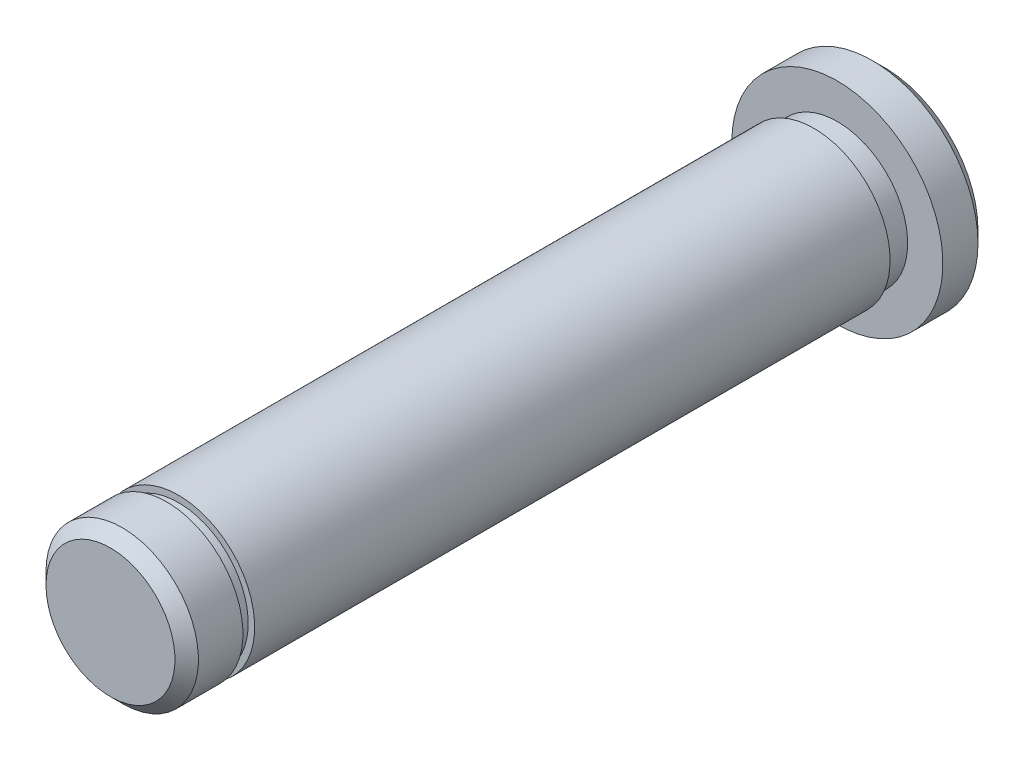
ISO-10303-21;
HEADER;
FILE_DESCRIPTION(('STEP AP214'),'2;1');
FILE_NAME('part.step','',(''),(''),'','','');
FILE_SCHEMA(('AUTOMOTIVE_DESIGN { 1 0 10303 214 1 1 1 1 }'));
ENDSEC;
DATA;
#1=APPLICATION_CONTEXT('core data for automotive mechanical design processes');
#2=APPLICATION_PROTOCOL_DEFINITION('international standard','automotive_design',2000,#1);
#3=PRODUCT_CONTEXT('',#1,'mechanical');
#4=PRODUCT('Part','Part','',(#3));
#5=PRODUCT_RELATED_PRODUCT_CATEGORY('part','',(#4));
#6=PRODUCT_DEFINITION_FORMATION('','',#4);
#7=PRODUCT_DEFINITION_CONTEXT('part definition',#1,'design');
#8=PRODUCT_DEFINITION('design','',#6,#7);
#9=PRODUCT_DEFINITION_SHAPE('','',#8);
#10=(LENGTH_UNIT() NAMED_UNIT(*) SI_UNIT(.MILLI.,.METRE.));
#11=(NAMED_UNIT(*) PLANE_ANGLE_UNIT() SI_UNIT($,.RADIAN.));
#12=(NAMED_UNIT(*) SI_UNIT($,.STERADIAN.) SOLID_ANGLE_UNIT());
#13=UNCERTAINTY_MEASURE_WITH_UNIT(LENGTH_MEASURE(1.E-05),#10,'distance_accuracy_value','');
#14=(GEOMETRIC_REPRESENTATION_CONTEXT(3) GLOBAL_UNCERTAINTY_ASSIGNED_CONTEXT((#13)) GLOBAL_UNIT_ASSIGNED_CONTEXT((#10,
#11,#12)) REPRESENTATION_CONTEXT('',''));
#15=CARTESIAN_POINT('',(0.,0.,0.));
#16=DIRECTION('',(0.,0.,1.));
#17=DIRECTION('',(1.,0.,0.));
#18=AXIS2_PLACEMENT_3D('',#15,#16,#17);
#19=CARTESIAN_POINT('',(0.,0.,66.));
#20=DIRECTION('',(0.,0.,1.));
#21=DIRECTION('',(1.,0.,0.));
#22=AXIS2_PLACEMENT_3D('',#19,#20,#21);
#23=PLANE('',#22);
#24=CARTESIAN_POINT('',(0.,0.,65.9999999999172));
#25=DIRECTION('',(0.,0.,-1.));
#26=DIRECTION('',(-1.,0.,0.));
#27=AXIS2_PLACEMENT_3D('',#24,#25,#26);
#28=CIRCLE('',#27,5.49999999998363);
#29=CARTESIAN_POINT('',(-5.49999999998363,0.,65.9999999999172));
#30=VERTEX_POINT('',#29);
#31=EDGE_CURVE('E17',#30,#30,#28,.T.);
#32=ORIENTED_EDGE('',*,*,#31,.F.);
#33=EDGE_LOOP('',(#32));
#34=FACE_BOUND('',#33,.T.);
#35=ADVANCED_FACE('F14',(#34),#23,.T.);
#36=CARTESIAN_POINT('',(0.,0.,0.));
#37=DIRECTION('',(0.,0.,1.));
#38=DIRECTION('',(1.,0.,0.));
#39=AXIS2_PLACEMENT_3D('',#36,#37,#38);
#40=PLANE('',#39);
#41=CARTESIAN_POINT('',(0.,0.,0.));
#42=DIRECTION('',(0.,0.,1.));
#43=DIRECTION('',(1.,0.,0.));
#44=AXIS2_PLACEMENT_3D('',#41,#42,#43);
#45=CIRCLE('',#44,8.);
#46=CARTESIAN_POINT('',(8.,0.,0.));
#47=VERTEX_POINT('',#46);
#48=EDGE_CURVE('E49',#47,#47,#45,.T.);
#49=ORIENTED_EDGE('',*,*,#48,.F.);
#50=EDGE_LOOP('',(#49));
#51=FACE_BOUND('',#50,.T.);
#52=ADVANCED_FACE('F61',(#51),#40,.F.);
#53=CARTESIAN_POINT('',(0.,0.,64.9999999999977));
#54=DIRECTION('',(0.,0.,-1.));
#55=DIRECTION('',(-1.,0.,0.));
#56=AXIS2_PLACEMENT_3D('',#53,#54,#55);
#57=CONICAL_SURFACE('',#56,6.49999999990314,0.785398163397448);
#58=ORIENTED_EDGE('',*,*,#31,.T.);
#59=EDGE_LOOP('',(#58));
#60=FACE_BOUND('',#59,.T.);
#61=CARTESIAN_POINT('',(0.,0.,65.));
#62=DIRECTION('',(0.,0.,-1.));
#63=DIRECTION('',(-1.,0.,0.));
#64=AXIS2_PLACEMENT_3D('',#61,#62,#63);
#65=CIRCLE('',#64,6.5);
#66=CARTESIAN_POINT('',(-6.5,0.,65.));
#67=VERTEX_POINT('',#66);
#68=EDGE_CURVE('E29',#67,#67,#65,.T.);
#69=ORIENTED_EDGE('',*,*,#68,.F.);
#70=EDGE_LOOP('',(#69));
#71=FACE_BOUND('',#70,.T.);
#72=ADVANCED_FACE('F57',(#60,#71),#57,.T.);
#73=CARTESIAN_POINT('',(0.,0.,0.999999999999995));
#74=DIRECTION('',(0.,0.,1.));
#75=DIRECTION('',(1.,0.,0.));
#76=AXIS2_PLACEMENT_3D('',#73,#74,#75);
#77=CONICAL_SURFACE('',#76,9.,0.78539816339745);
#78=CARTESIAN_POINT('',(0.,0.,0.999999999999996));
#79=DIRECTION('',(0.,0.,-1.));
#80=DIRECTION('',(-1.,0.,0.));
#81=AXIS2_PLACEMENT_3D('',#78,#79,#80);
#82=CIRCLE('',#81,9.);
#83=CARTESIAN_POINT('',(-9.,0.,0.999999999999996));
#84=VERTEX_POINT('',#83);
#85=EDGE_CURVE('E48',#84,#84,#82,.F.);
#86=ORIENTED_EDGE('',*,*,#85,.F.);
#87=EDGE_LOOP('',(#86));
#88=FACE_BOUND('',#87,.T.);
#89=ORIENTED_EDGE('',*,*,#48,.T.);
#90=EDGE_LOOP('',(#89));
#91=FACE_BOUND('',#90,.T.);
#92=ADVANCED_FACE('F106',(#88,#91),#77,.T.);
#93=CARTESIAN_POINT('',(0.,0.,66.));
#94=DIRECTION('',(0.,0.,-1.));
#95=DIRECTION('',(-1.,0.,0.));
#96=AXIS2_PLACEMENT_3D('',#93,#94,#95);
#97=CYLINDRICAL_SURFACE('',#96,6.5);
#98=ORIENTED_EDGE('',*,*,#68,.T.);
#99=EDGE_LOOP('',(#98));
#100=FACE_BOUND('',#99,.T.);
#101=CARTESIAN_POINT('',(0.,0.,61.2));
#102=DIRECTION('',(0.,0.,-1.));
#103=DIRECTION('',(-1.,0.,0.));
#104=AXIS2_PLACEMENT_3D('',#101,#102,#103);
#105=CIRCLE('',#104,6.5);
#106=CARTESIAN_POINT('',(-6.5,0.,61.2));
#107=VERTEX_POINT('',#106);
#108=EDGE_CURVE('E46',#107,#107,#105,.F.);
#109=ORIENTED_EDGE('',*,*,#108,.T.);
#110=EDGE_LOOP('',(#109));
#111=FACE_BOUND('',#110,.T.);
#112=ADVANCED_FACE('F102',(#100,#111),#97,.T.);
#113=CARTESIAN_POINT('',(0.,0.,4.));
#114=DIRECTION('',(0.,0.,-1.));
#115=DIRECTION('',(-1.,0.,0.));
#116=AXIS2_PLACEMENT_3D('',#113,#114,#115);
#117=CYLINDRICAL_SURFACE('',#116,9.);
#118=ORIENTED_EDGE('',*,*,#85,.T.);
#119=EDGE_LOOP('',(#118));
#120=FACE_BOUND('',#119,.T.);
#121=CARTESIAN_POINT('',(0.,0.,4.));
#122=DIRECTION('',(0.,0.,-1.));
#123=DIRECTION('',(-1.,0.,0.));
#124=AXIS2_PLACEMENT_3D('',#121,#122,#123);
#125=CIRCLE('',#124,9.);
#126=CARTESIAN_POINT('',(-9.,0.,4.));
#127=VERTEX_POINT('',#126);
#128=EDGE_CURVE('E43',#127,#127,#125,.F.);
#129=ORIENTED_EDGE('',*,*,#128,.F.);
#130=EDGE_LOOP('',(#129));
#131=FACE_BOUND('',#130,.T.);
#132=ADVANCED_FACE('F98',(#120,#131),#117,.T.);
#133=CARTESIAN_POINT('',(0.,0.,61.2));
#134=DIRECTION('',(0.,0.,1.));
#135=DIRECTION('',(1.,0.,0.));
#136=AXIS2_PLACEMENT_3D('',#133,#134,#135);
#137=PLANE('',#136);
#138=ORIENTED_EDGE('',*,*,#108,.F.);
#139=EDGE_LOOP('',(#138));
#140=FACE_BOUND('',#139,.T.);
#141=CARTESIAN_POINT('',(0.,0.,61.2));
#142=DIRECTION('',(0.,0.,-1.));
#143=DIRECTION('',(-1.,0.,0.));
#144=AXIS2_PLACEMENT_3D('',#141,#142,#143);
#145=CIRCLE('',#144,5.95);
#146=CARTESIAN_POINT('',(-5.95,0.,61.2));
#147=VERTEX_POINT('',#146);
#148=EDGE_CURVE('E40',#147,#147,#145,.T.);
#149=ORIENTED_EDGE('',*,*,#148,.F.);
#150=EDGE_LOOP('',(#149));
#151=FACE_BOUND('',#150,.T.);
#152=ADVANCED_FACE('F94',(#140,#151),#137,.F.);
#153=CARTESIAN_POINT('',(0.,0.,4.));
#154=DIRECTION('',(0.,0.,1.));
#155=DIRECTION('',(1.,0.,0.));
#156=AXIS2_PLACEMENT_3D('',#153,#154,#155);
#157=PLANE('',#156);
#158=CARTESIAN_POINT('',(0.,0.,4.));
#159=DIRECTION('',(0.,0.,-1.));
#160=DIRECTION('',(-1.,0.,0.));
#161=AXIS2_PLACEMENT_3D('',#158,#159,#160);
#162=CIRCLE('',#161,6.);
#163=CARTESIAN_POINT('',(-6.,0.,4.));
#164=VERTEX_POINT('',#163);
#165=EDGE_CURVE('E37',#164,#164,#162,.F.);
#166=ORIENTED_EDGE('',*,*,#165,.F.);
#167=EDGE_LOOP('',(#166));
#168=FACE_BOUND('',#167,.T.);
#169=ORIENTED_EDGE('',*,*,#128,.T.);
#170=EDGE_LOOP('',(#169));
#171=FACE_BOUND('',#170,.T.);
#172=ADVANCED_FACE('F90',(#168,#171),#157,.T.);
#173=CARTESIAN_POINT('',(0.,0.,61.2));
#174=DIRECTION('',(0.,0.,-1.));
#175=DIRECTION('',(-1.,0.,0.));
#176=AXIS2_PLACEMENT_3D('',#173,#174,#175);
#177=CYLINDRICAL_SURFACE('',#176,5.95);
#178=CARTESIAN_POINT('',(0.,0.,60.2));
#179=DIRECTION('',(0.,0.,-1.));
#180=DIRECTION('',(-1.,0.,0.));
#181=AXIS2_PLACEMENT_3D('',#178,#179,#180);
#182=CIRCLE('',#181,5.95);
#183=CARTESIAN_POINT('',(-5.95,0.,60.2));
#184=VERTEX_POINT('',#183);
#185=EDGE_CURVE('E34',#184,#184,#182,.T.);
#186=ORIENTED_EDGE('',*,*,#185,.F.);
#187=EDGE_LOOP('',(#186));
#188=FACE_BOUND('',#187,.T.);
#189=ORIENTED_EDGE('',*,*,#148,.T.);
#190=EDGE_LOOP('',(#189));
#191=FACE_BOUND('',#190,.T.);
#192=ADVANCED_FACE('F86',(#188,#191),#177,.T.);
#193=CARTESIAN_POINT('',(0.,0.,6.));
#194=DIRECTION('',(0.,0.,-1.));
#195=DIRECTION('',(-1.,0.,0.));
#196=AXIS2_PLACEMENT_3D('',#193,#194,#195);
#197=CYLINDRICAL_SURFACE('',#196,6.);
#198=CARTESIAN_POINT('',(0.,0.,6.));
#199=DIRECTION('',(0.,0.,-1.));
#200=DIRECTION('',(-1.,0.,0.));
#201=AXIS2_PLACEMENT_3D('',#198,#199,#200);
#202=CIRCLE('',#201,6.);
#203=CARTESIAN_POINT('',(-6.,0.,6.));
#204=VERTEX_POINT('',#203);
#205=EDGE_CURVE('E26',#204,#204,#202,.T.);
#206=ORIENTED_EDGE('',*,*,#205,.T.);
#207=EDGE_LOOP('',(#206));
#208=FACE_BOUND('',#207,.T.);
#209=ORIENTED_EDGE('',*,*,#165,.T.);
#210=EDGE_LOOP('',(#209));
#211=FACE_BOUND('',#210,.T.);
#212=ADVANCED_FACE('F82',(#208,#211),#197,.T.);
#213=CARTESIAN_POINT('',(0.,0.,60.2));
#214=DIRECTION('',(0.,0.,1.));
#215=DIRECTION('',(1.,0.,0.));
#216=AXIS2_PLACEMENT_3D('',#213,#214,#215);
#217=PLANE('',#216);
#218=CARTESIAN_POINT('',(0.,0.,60.2));
#219=DIRECTION('',(0.,0.,-1.));
#220=DIRECTION('',(-1.,0.,0.));
#221=AXIS2_PLACEMENT_3D('',#218,#219,#220);
#222=CIRCLE('',#221,6.5);
#223=CARTESIAN_POINT('',(-6.5,0.,60.2));
#224=VERTEX_POINT('',#223);
#225=EDGE_CURVE('E21',#224,#224,#222,.T.);
#226=ORIENTED_EDGE('',*,*,#225,.F.);
#227=EDGE_LOOP('',(#226));
#228=FACE_BOUND('',#227,.T.);
#229=ORIENTED_EDGE('',*,*,#185,.T.);
#230=EDGE_LOOP('',(#229));
#231=FACE_BOUND('',#230,.T.);
#232=ADVANCED_FACE('F75',(#228,#231),#217,.T.);
#233=CARTESIAN_POINT('',(0.,0.,6.));
#234=DIRECTION('',(0.,0.,1.));
#235=DIRECTION('',(1.,0.,0.));
#236=AXIS2_PLACEMENT_3D('',#233,#234,#235);
#237=PLANE('',#236);
#238=CARTESIAN_POINT('',(0.,0.,6.));
#239=DIRECTION('',(0.,0.,-1.));
#240=DIRECTION('',(-1.,0.,0.));
#241=AXIS2_PLACEMENT_3D('',#238,#239,#240);
#242=CIRCLE('',#241,6.5);
#243=CARTESIAN_POINT('',(-6.5,0.,6.));
#244=VERTEX_POINT('',#243);
#245=EDGE_CURVE('E10',#244,#244,#242,.F.);
#246=ORIENTED_EDGE('',*,*,#245,.F.);
#247=EDGE_LOOP('',(#246));
#248=FACE_BOUND('',#247,.T.);
#249=ORIENTED_EDGE('',*,*,#205,.F.);
#250=EDGE_LOOP('',(#249));
#251=FACE_BOUND('',#250,.T.);
#252=ADVANCED_FACE('F69',(#248,#251),#237,.F.);
#253=CARTESIAN_POINT('',(0.,0.,66.));
#254=DIRECTION('',(0.,0.,-1.));
#255=DIRECTION('',(-1.,0.,0.));
#256=AXIS2_PLACEMENT_3D('',#253,#254,#255);
#257=CYLINDRICAL_SURFACE('',#256,6.5);
#258=ORIENTED_EDGE('',*,*,#245,.T.);
#259=EDGE_LOOP('',(#258));
#260=FACE_BOUND('',#259,.T.);
#261=ORIENTED_EDGE('',*,*,#225,.T.);
#262=EDGE_LOOP('',(#261));
#263=FACE_BOUND('',#262,.T.);
#264=ADVANCED_FACE('F67',(#260,#263),#257,.T.);
#265=CLOSED_SHELL('',(#35,#52,#72,#92,#112,#132,#152,#172,#192,#212,#232,#252,#264));
#266=MANIFOLD_SOLID_BREP('B1',#265);
#267=ADVANCED_BREP_SHAPE_REPRESENTATION('',(#18,#266),#14);
#268=SHAPE_DEFINITION_REPRESENTATION(#9,#267);
ENDSEC;
END-ISO-10303-21;
